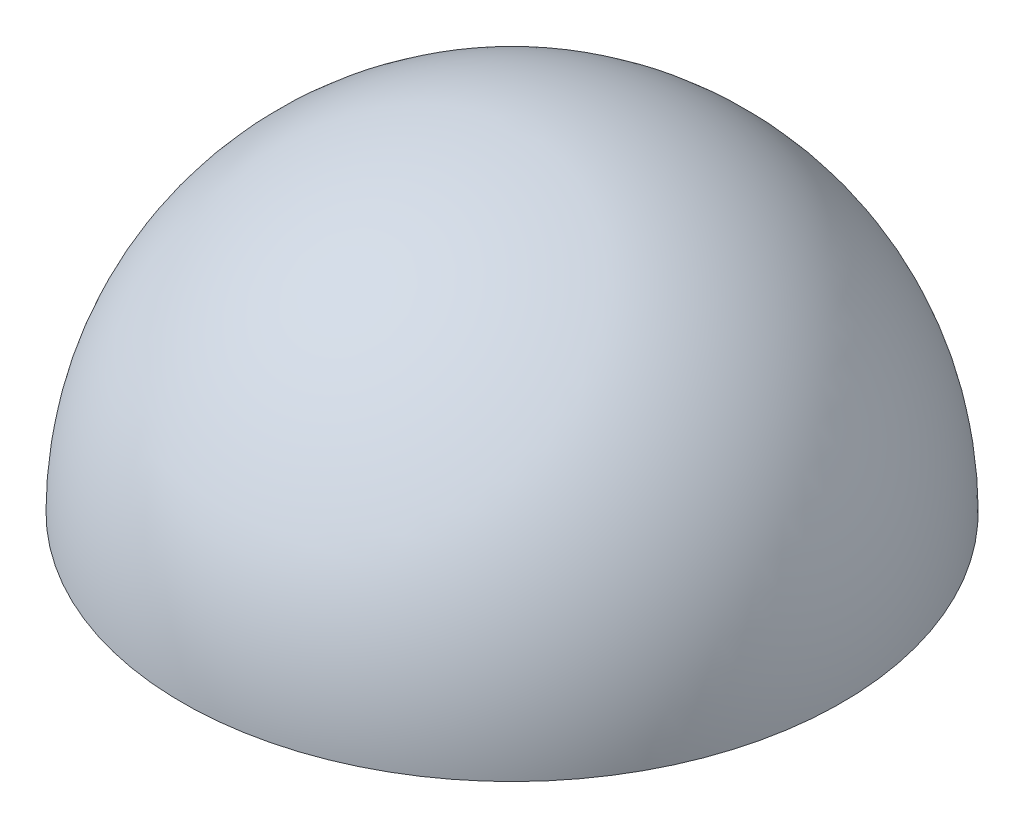
ISO-10303-21;
HEADER;
FILE_DESCRIPTION(('STEP AP214'),'2;1');
FILE_NAME('part.step','',(''),(''),'','','');
FILE_SCHEMA(('AUTOMOTIVE_DESIGN { 1 0 10303 214 1 1 1 1 }'));
ENDSEC;
DATA;
#1=APPLICATION_CONTEXT('core data for automotive mechanical design processes');
#2=APPLICATION_PROTOCOL_DEFINITION('international standard','automotive_design',2000,#1);
#3=PRODUCT_CONTEXT('',#1,'mechanical');
#4=PRODUCT('Part','Part','',(#3));
#5=PRODUCT_RELATED_PRODUCT_CATEGORY('part','',(#4));
#6=PRODUCT_DEFINITION_FORMATION('','',#4);
#7=PRODUCT_DEFINITION_CONTEXT('part definition',#1,'design');
#8=PRODUCT_DEFINITION('design','',#6,#7);
#9=PRODUCT_DEFINITION_SHAPE('','',#8);
#10=(LENGTH_UNIT() NAMED_UNIT(*) SI_UNIT(.MILLI.,.METRE.));
#11=(NAMED_UNIT(*) PLANE_ANGLE_UNIT() SI_UNIT($,.RADIAN.));
#12=(NAMED_UNIT(*) SI_UNIT($,.STERADIAN.) SOLID_ANGLE_UNIT());
#13=UNCERTAINTY_MEASURE_WITH_UNIT(LENGTH_MEASURE(1.E-05),#10,'distance_accuracy_value','');
#14=(GEOMETRIC_REPRESENTATION_CONTEXT(3) GLOBAL_UNCERTAINTY_ASSIGNED_CONTEXT((#13)) GLOBAL_UNIT_ASSIGNED_CONTEXT((#10,
#11,#12)) REPRESENTATION_CONTEXT('',''));
#15=CARTESIAN_POINT('',(0.,0.,0.));
#16=DIRECTION('',(0.,0.,1.));
#17=DIRECTION('',(1.,0.,0.));
#18=AXIS2_PLACEMENT_3D('',#15,#16,#17);
#19=CARTESIAN_POINT('',(0.,-54.9662706692072,7.03359861643882));
#20=DIRECTION('',(0.,-1.,0.));
#21=DIRECTION('',(0.,0.,-1.));
#22=AXIS2_PLACEMENT_3D('',#19,#20,#21);
#23=SPHERICAL_SURFACE('',#22,5.);
#24=CARTESIAN_POINT('',(0.,-54.9662706692072,7.03359861643882));
#25=DIRECTION('',(0.,-1.,0.));
#26=DIRECTION('',(0.,0.,-1.));
#27=AXIS2_PLACEMENT_3D('',#24,#25,#26);
#28=CIRCLE('',#27,5.);
#29=CARTESIAN_POINT('',(0.,-54.9662706692072,2.03359861643882));
#30=VERTEX_POINT('',#29);
#31=EDGE_CURVE('E12',#30,#30,#28,.T.);
#32=ORIENTED_EDGE('',*,*,#31,.F.);
#33=EDGE_LOOP('',(#32));
#34=FACE_BOUND('',#33,.T.);
#35=ADVANCED_FACE('F41',(#34),#23,.T.);
#36=CARTESIAN_POINT('',(0.,-54.9662706692072,7.03359861643882));
#37=DIRECTION('',(0.,-1.,0.));
#38=DIRECTION('',(0.,0.,-1.));
#39=AXIS2_PLACEMENT_3D('',#36,#37,#38);
#40=PLANE('',#39);
#41=ORIENTED_EDGE('',*,*,#31,.T.);
#42=EDGE_LOOP('',(#41));
#43=FACE_BOUND('',#42,.T.);
#44=ADVANCED_FACE('F48',(#43),#40,.T.);
#45=CLOSED_SHELL('',(#35,#44));
#46=MANIFOLD_SOLID_BREP('B2',#45);
#47=ADVANCED_BREP_SHAPE_REPRESENTATION('',(#18,#46),#14);
#48=SHAPE_DEFINITION_REPRESENTATION(#9,#47);
ENDSEC;
END-ISO-10303-21;
